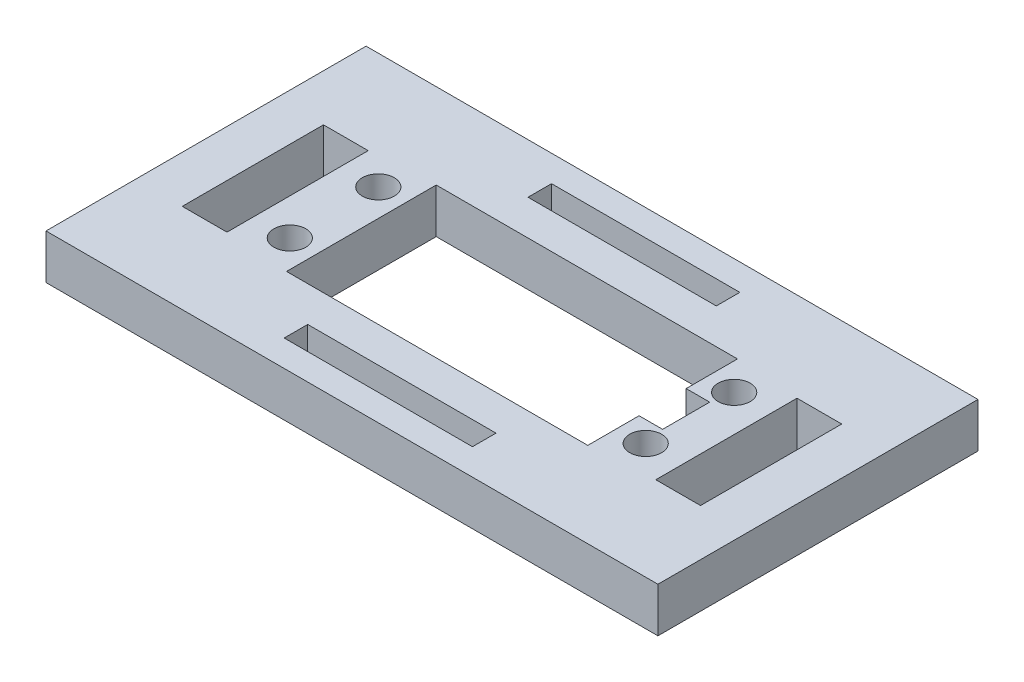
ISO-10303-21;
HEADER;
FILE_DESCRIPTION(('STEP AP214'),'2;1');
FILE_NAME('part.step','',(''),(''),'','','');
FILE_SCHEMA(('AUTOMOTIVE_DESIGN { 1 0 10303 214 1 1 1 1 }'));
ENDSEC;
DATA;
#1=APPLICATION_CONTEXT('core data for automotive mechanical design processes');
#2=APPLICATION_PROTOCOL_DEFINITION('international standard','automotive_design',2000,#1);
#3=PRODUCT_CONTEXT('',#1,'mechanical');
#4=PRODUCT('Part','Part','',(#3));
#5=PRODUCT_RELATED_PRODUCT_CATEGORY('part','',(#4));
#6=PRODUCT_DEFINITION_FORMATION('','',#4);
#7=PRODUCT_DEFINITION_CONTEXT('part definition',#1,'design');
#8=PRODUCT_DEFINITION('design','',#6,#7);
#9=PRODUCT_DEFINITION_SHAPE('','',#8);
#10=(LENGTH_UNIT() NAMED_UNIT(*) SI_UNIT(.MILLI.,.METRE.));
#11=(NAMED_UNIT(*) PLANE_ANGLE_UNIT() SI_UNIT($,.RADIAN.));
#12=(NAMED_UNIT(*) SI_UNIT($,.STERADIAN.) SOLID_ANGLE_UNIT());
#13=UNCERTAINTY_MEASURE_WITH_UNIT(LENGTH_MEASURE(1.E-05),#10,'distance_accuracy_value','');
#14=(GEOMETRIC_REPRESENTATION_CONTEXT(3) GLOBAL_UNCERTAINTY_ASSIGNED_CONTEXT((#13)) GLOBAL_UNIT_ASSIGNED_CONTEXT((#10,
#11,#12)) REPRESENTATION_CONTEXT('',''));
#15=CARTESIAN_POINT('',(0.,0.,0.));
#16=DIRECTION('',(0.,0.,1.));
#17=DIRECTION('',(1.,0.,0.));
#18=AXIS2_PLACEMENT_3D('',#15,#16,#17);
#19=CARTESIAN_POINT('',(40.64,6.0325,0.));
#20=DIRECTION('',(-1.,0.,0.));
#21=DIRECTION('',(0.,0.,1.));
#22=AXIS2_PLACEMENT_3D('',#19,#20,#21);
#23=PLANE('',#22);
#24=DIRECTION('',(0.,1.,0.));
#25=VECTOR('',#24,1.);
#26=CARTESIAN_POINT('',(40.64,-7.09951582856183,-6.9215));
#27=LINE('',#26,#25);
#28=CARTESIAN_POINT('',(40.64,0.,-6.9215));
#29=VERTEX_POINT('',#28);
#30=CARTESIAN_POINT('',(40.64,6.0325,-6.9215));
#31=VERTEX_POINT('',#30);
#32=EDGE_CURVE('E267',#29,#31,#27,.T.);
#33=ORIENTED_EDGE('',*,*,#32,.F.);
#34=DIRECTION('',(0.,0.,-1.));
#35=VECTOR('',#34,1.);
#36=CARTESIAN_POINT('',(40.64,0.,0.));
#37=LINE('',#36,#35);
#38=CARTESIAN_POINT('',(40.64,0.,0.));
#39=VERTEX_POINT('',#38);
#40=EDGE_CURVE('E252',#39,#29,#37,.T.);
#41=ORIENTED_EDGE('',*,*,#40,.F.);
#42=DIRECTION('',(0.,-1.,0.));
#43=VECTOR('',#42,1.);
#44=CARTESIAN_POINT('',(40.64,6.0325,0.));
#45=LINE('',#44,#43);
#46=CARTESIAN_POINT('',(40.64,6.0325,0.));
#47=VERTEX_POINT('',#46);
#48=EDGE_CURVE('E510',#47,#39,#45,.T.);
#49=ORIENTED_EDGE('',*,*,#48,.F.);
#50=DIRECTION('',(0.,0.,-1.));
#51=VECTOR('',#50,1.);
#52=CARTESIAN_POINT('',(40.64,6.0325,0.));
#53=LINE('',#52,#51);
#54=EDGE_CURVE('E483',#47,#31,#53,.T.);
#55=ORIENTED_EDGE('',*,*,#54,.T.);
#56=EDGE_LOOP('',(#33,#41,#49,#55));
#57=FACE_BOUND('',#56,.T.);
#58=ADVANCED_FACE('F40',(#57),#23,.T.);
#59=CARTESIAN_POINT('',(0.,6.0325,0.));
#60=DIRECTION('',(0.,-1.,0.));
#61=DIRECTION('',(0.,0.,-1.));
#62=AXIS2_PLACEMENT_3D('',#59,#60,#61);
#63=PLANE('',#62);
#64=DIRECTION('',(0.,0.,1.));
#65=VECTOR('',#64,1.);
#66=CARTESIAN_POINT('',(7.62,6.0325,4.7625));
#67=LINE('',#66,#65);
#68=CARTESIAN_POINT('',(7.62,6.0325,4.7625));
#69=VERTEX_POINT('',#68);
#70=CARTESIAN_POINT('',(7.62,6.0325,7.9375));
#71=VERTEX_POINT('',#70);
#72=EDGE_CURVE('E314',#69,#71,#67,.T.);
#73=ORIENTED_EDGE('',*,*,#72,.F.);
#74=DIRECTION('',(-1.,0.,0.));
#75=VECTOR('',#74,1.);
#76=CARTESIAN_POINT('',(7.62,6.0325,4.7625));
#77=LINE('',#76,#75);
#78=CARTESIAN_POINT('',(33.02,6.0325,4.7625));
#79=VERTEX_POINT('',#78);
#80=EDGE_CURVE('E325',#79,#69,#77,.T.);
#81=ORIENTED_EDGE('',*,*,#80,.F.);
#82=DIRECTION('',(0.,0.,-1.));
#83=VECTOR('',#82,1.);
#84=CARTESIAN_POINT('',(33.02,6.0325,4.7625));
#85=LINE('',#84,#83);
#86=CARTESIAN_POINT('',(33.02,6.0325,7.9375));
#87=VERTEX_POINT('',#86);
#88=EDGE_CURVE('E321',#87,#79,#85,.T.);
#89=ORIENTED_EDGE('',*,*,#88,.F.);
#90=DIRECTION('',(1.,0.,0.));
#91=VECTOR('',#90,1.);
#92=CARTESIAN_POINT('',(7.62,6.0325,7.9375));
#93=LINE('',#92,#91);
#94=EDGE_CURVE('E317',#71,#87,#93,.T.);
#95=ORIENTED_EDGE('',*,*,#94,.F.);
#96=EDGE_LOOP('',(#73,#81,#89,#95));
#97=FACE_BOUND('',#96,.T.);
#98=DIRECTION('',(0.,0.,1.));
#99=VECTOR('',#98,1.);
#100=CARTESIAN_POINT('',(7.62,6.0325,-24.9555));
#101=LINE('',#100,#99);
#102=CARTESIAN_POINT('',(7.62,6.0325,-28.1305));
#103=VERTEX_POINT('',#102);
#104=CARTESIAN_POINT('',(7.62,6.0325,-24.9555));
#105=VERTEX_POINT('',#104);
#106=EDGE_CURVE('E400',#103,#105,#101,.T.);
#107=ORIENTED_EDGE('',*,*,#106,.F.);
#108=DIRECTION('',(-1.,0.,0.));
#109=VECTOR('',#108,1.);
#110=CARTESIAN_POINT('',(7.62,6.0325,-28.1305));
#111=LINE('',#110,#109);
#112=CARTESIAN_POINT('',(33.02,6.0325,-28.1305));
#113=VERTEX_POINT('',#112);
#114=EDGE_CURVE('E411',#113,#103,#111,.T.);
#115=ORIENTED_EDGE('',*,*,#114,.F.);
#116=DIRECTION('',(0.,0.,-1.));
#117=VECTOR('',#116,1.);
#118=CARTESIAN_POINT('',(33.02,6.0325,-24.9555));
#119=LINE('',#118,#117);
#120=CARTESIAN_POINT('',(33.02,6.0325,-24.9555));
#121=VERTEX_POINT('',#120);
#122=EDGE_CURVE('E407',#121,#113,#119,.T.);
#123=ORIENTED_EDGE('',*,*,#122,.F.);
#124=DIRECTION('',(1.,0.,0.));
#125=VECTOR('',#124,1.);
#126=CARTESIAN_POINT('',(7.62,6.0325,-24.9555));
#127=LINE('',#126,#125);
#128=EDGE_CURVE('E403',#105,#121,#127,.T.);
#129=ORIENTED_EDGE('',*,*,#128,.F.);
#130=EDGE_LOOP('',(#107,#115,#123,#129));
#131=FACE_BOUND('',#130,.T.);
#132=DIRECTION('',(0.,0.,1.));
#133=VECTOR('',#132,1.);
#134=CARTESIAN_POINT('',(-20.955,6.0325,11.4935));
#135=LINE('',#134,#133);
#136=CARTESIAN_POINT('',(-20.955,6.0325,-31.6865));
#137=VERTEX_POINT('',#136);
#138=CARTESIAN_POINT('',(-20.955,6.0325,11.4935));
#139=VERTEX_POINT('',#138);
#140=EDGE_CURVE('E518',#137,#139,#135,.T.);
#141=ORIENTED_EDGE('',*,*,#140,.T.);
#142=DIRECTION('',(1.,0.,0.));
#143=VECTOR('',#142,1.);
#144=CARTESIAN_POINT('',(-20.955,6.0325,11.4935));
#145=LINE('',#144,#143);
#146=CARTESIAN_POINT('',(61.595,6.0325,11.4935));
#147=VERTEX_POINT('',#146);
#148=EDGE_CURVE('E522',#139,#147,#145,.T.);
#149=ORIENTED_EDGE('',*,*,#148,.T.);
#150=DIRECTION('',(0.,0.,-1.));
#151=VECTOR('',#150,1.);
#152=CARTESIAN_POINT('',(61.595,6.0325,11.4935));
#153=LINE('',#152,#151);
#154=CARTESIAN_POINT('',(61.595,6.0325,-31.6865));
#155=VERTEX_POINT('',#154);
#156=EDGE_CURVE('E526',#147,#155,#153,.T.);
#157=ORIENTED_EDGE('',*,*,#156,.T.);
#158=DIRECTION('',(-1.,0.,0.));
#159=VECTOR('',#158,1.);
#160=CARTESIAN_POINT('',(-20.955,6.0325,-31.6865));
#161=LINE('',#160,#159);
#162=EDGE_CURVE('E529',#155,#137,#161,.T.);
#163=ORIENTED_EDGE('',*,*,#162,.T.);
#164=EDGE_LOOP('',(#141,#149,#157,#163));
#165=FACE_BOUND('',#164,.T.);
#166=DIRECTION('',(0.,0.,-1.));
#167=VECTOR('',#166,1.);
#168=CARTESIAN_POINT('',(43.815,6.0325,-13.2715));
#169=LINE('',#168,#167);
#170=CARTESIAN_POINT('',(43.815,6.0325,-6.9215));
#171=VERTEX_POINT('',#170);
#172=CARTESIAN_POINT('',(43.815,6.0325,-13.2715));
#173=VERTEX_POINT('',#172);
#174=EDGE_CURVE('E256',#171,#173,#169,.T.);
#175=ORIENTED_EDGE('',*,*,#174,.F.);
#176=DIRECTION('',(1.,0.,0.));
#177=VECTOR('',#176,1.);
#178=CARTESIAN_POINT('',(40.64,6.0325,-6.9215));
#179=LINE('',#178,#177);
#180=EDGE_CURVE('E243',#31,#171,#179,.T.);
#181=ORIENTED_EDGE('',*,*,#180,.F.);
#182=ORIENTED_EDGE('',*,*,#54,.F.);
#183=DIRECTION('',(1.,0.,0.));
#184=VECTOR('',#183,1.);
#185=CARTESIAN_POINT('',(0.,6.0325,0.));
#186=LINE('',#185,#184);
#187=CARTESIAN_POINT('',(0.,6.0325,0.));
#188=VERTEX_POINT('',#187);
#189=EDGE_CURVE('E478',#188,#47,#186,.T.);
#190=ORIENTED_EDGE('',*,*,#189,.F.);
#191=DIRECTION('',(0.,0.,1.));
#192=VECTOR('',#191,1.);
#193=CARTESIAN_POINT('',(0.,6.0325,0.));
#194=LINE('',#193,#192);
#195=CARTESIAN_POINT('',(0.,6.0325,-20.193));
#196=VERTEX_POINT('',#195);
#197=EDGE_CURVE('E475',#196,#188,#194,.T.);
#198=ORIENTED_EDGE('',*,*,#197,.F.);
#199=DIRECTION('',(-1.,0.,0.));
#200=VECTOR('',#199,1.);
#201=CARTESIAN_POINT('',(0.,6.0325,-20.193));
#202=LINE('',#201,#200);
#203=CARTESIAN_POINT('',(40.64,6.0325,-20.193));
#204=VERTEX_POINT('',#203);
#205=EDGE_CURVE('E487',#204,#196,#202,.T.);
#206=ORIENTED_EDGE('',*,*,#205,.F.);
#207=CARTESIAN_POINT('',(40.64,6.0325,-13.2715));
#208=VERTEX_POINT('',#207);
#209=EDGE_CURVE('E482',#208,#204,#53,.T.);
#210=ORIENTED_EDGE('',*,*,#209,.F.);
#211=DIRECTION('',(-1.,0.,0.));
#212=VECTOR('',#211,1.);
#213=CARTESIAN_POINT('',(40.64,6.0325,-13.2715));
#214=LINE('',#213,#212);
#215=EDGE_CURVE('E56',#173,#208,#214,.T.);
#216=ORIENTED_EDGE('',*,*,#215,.F.);
#217=EDGE_LOOP('',(#175,#181,#182,#190,#198,#206,#210,#216));
#218=FACE_BOUND('',#217,.T.);
#219=CARTESIAN_POINT('',(44.323,6.0325,-16.0655));
#220=DIRECTION('',(0.,1.,0.));
#221=DIRECTION('',(0.,0.,1.));
#222=AXIS2_PLACEMENT_3D('',#219,#220,#221);
#223=CIRCLE('',#222,2.159);
#224=CARTESIAN_POINT('',(44.323,6.0325,-13.9065));
#225=VERTEX_POINT('',#224);
#226=EDGE_CURVE('E467',#225,#225,#223,.T.);
#227=ORIENTED_EDGE('',*,*,#226,.F.);
#228=EDGE_LOOP('',(#227));
#229=FACE_BOUND('',#228,.T.);
#230=CARTESIAN_POINT('',(44.323,6.0325,-4.1275));
#231=DIRECTION('',(0.,1.,0.));
#232=DIRECTION('',(0.,0.,1.));
#233=AXIS2_PLACEMENT_3D('',#230,#231,#232);
#234=CIRCLE('',#233,2.159);
#235=CARTESIAN_POINT('',(44.323,6.0325,-1.9685));
#236=VERTEX_POINT('',#235);
#237=EDGE_CURVE('E459',#236,#236,#234,.T.);
#238=ORIENTED_EDGE('',*,*,#237,.F.);
#239=EDGE_LOOP('',(#238));
#240=FACE_BOUND('',#239,.T.);
#241=CARTESIAN_POINT('',(-3.683,6.0325,-4.1275));
#242=DIRECTION('',(0.,1.,0.));
#243=DIRECTION('',(0.,0.,-1.));
#244=AXIS2_PLACEMENT_3D('',#241,#242,#243);
#245=CIRCLE('',#244,2.159);
#246=CARTESIAN_POINT('',(-3.683,6.0325,-6.2865));
#247=VERTEX_POINT('',#246);
#248=EDGE_CURVE('E451',#247,#247,#245,.T.);
#249=ORIENTED_EDGE('',*,*,#248,.F.);
#250=EDGE_LOOP('',(#249));
#251=FACE_BOUND('',#250,.T.);
#252=CARTESIAN_POINT('',(-3.683,6.0325,-16.0655));
#253=DIRECTION('',(0.,1.,0.));
#254=DIRECTION('',(0.,0.,-1.));
#255=AXIS2_PLACEMENT_3D('',#252,#253,#254);
#256=CIRCLE('',#255,2.159);
#257=CARTESIAN_POINT('',(-3.683,6.0325,-18.2245));
#258=VERTEX_POINT('',#257);
#259=EDGE_CURVE('E443',#258,#258,#256,.T.);
#260=ORIENTED_EDGE('',*,*,#259,.F.);
#261=EDGE_LOOP('',(#260));
#262=FACE_BOUND('',#261,.T.);
#263=DIRECTION('',(0.,0.,1.));
#264=VECTOR('',#263,1.);
#265=CARTESIAN_POINT('',(-14.63675,6.0325,-19.6215));
#266=LINE('',#265,#264);
#267=CARTESIAN_POINT('',(-14.63675,6.0325,-19.6215));
#268=VERTEX_POINT('',#267);
#269=CARTESIAN_POINT('',(-14.63675,6.0325,-0.571499999999998));
#270=VERTEX_POINT('',#269);
#271=EDGE_CURVE('E357',#268,#270,#266,.T.);
#272=ORIENTED_EDGE('',*,*,#271,.F.);
#273=DIRECTION('',(-1.,0.,0.));
#274=VECTOR('',#273,1.);
#275=CARTESIAN_POINT('',(-14.63675,6.0325,-19.6215));
#276=LINE('',#275,#274);
#277=CARTESIAN_POINT('',(-8.60425,6.0325,-19.6215));
#278=VERTEX_POINT('',#277);
#279=EDGE_CURVE('E368',#278,#268,#276,.T.);
#280=ORIENTED_EDGE('',*,*,#279,.F.);
#281=DIRECTION('',(0.,0.,-1.));
#282=VECTOR('',#281,1.);
#283=CARTESIAN_POINT('',(-8.60425,6.0325,-19.6215));
#284=LINE('',#283,#282);
#285=CARTESIAN_POINT('',(-8.60425,6.0325,-0.5715));
#286=VERTEX_POINT('',#285);
#287=EDGE_CURVE('E364',#286,#278,#284,.T.);
#288=ORIENTED_EDGE('',*,*,#287,.F.);
#289=DIRECTION('',(1.,0.,0.));
#290=VECTOR('',#289,1.);
#291=CARTESIAN_POINT('',(-14.63675,6.0325,-0.571499999999998));
#292=LINE('',#291,#290);
#293=EDGE_CURVE('E360',#270,#286,#292,.T.);
#294=ORIENTED_EDGE('',*,*,#293,.F.);
#295=EDGE_LOOP('',(#272,#280,#288,#294));
#296=FACE_BOUND('',#295,.T.);
#297=DIRECTION('',(0.,0.,-1.));
#298=VECTOR('',#297,1.);
#299=CARTESIAN_POINT('',(55.27675,6.0325,-19.6215));
#300=LINE('',#299,#298);
#301=CARTESIAN_POINT('',(55.27675,6.0325,-0.571499999999999));
#302=VERTEX_POINT('',#301);
#303=CARTESIAN_POINT('',(55.27675,6.0325,-19.6215));
#304=VERTEX_POINT('',#303);
#305=EDGE_CURVE('E273',#302,#304,#300,.T.);
#306=ORIENTED_EDGE('',*,*,#305,.F.);
#307=DIRECTION('',(1.,0.,0.));
#308=VECTOR('',#307,1.);
#309=CARTESIAN_POINT('',(55.27675,6.0325,-0.571499999999999));
#310=LINE('',#309,#308);
#311=CARTESIAN_POINT('',(49.24425,6.0325,-0.571499999999999));
#312=VERTEX_POINT('',#311);
#313=EDGE_CURVE('E283',#312,#302,#310,.T.);
#314=ORIENTED_EDGE('',*,*,#313,.F.);
#315=DIRECTION('',(0.,0.,1.));
#316=VECTOR('',#315,1.);
#317=CARTESIAN_POINT('',(49.24425,6.0325,-19.6215));
#318=LINE('',#317,#316);
#319=CARTESIAN_POINT('',(49.24425,6.0325,-19.6215));
#320=VERTEX_POINT('',#319);
#321=EDGE_CURVE('E280',#320,#312,#318,.T.);
#322=ORIENTED_EDGE('',*,*,#321,.F.);
#323=DIRECTION('',(-1.,0.,0.));
#324=VECTOR('',#323,1.);
#325=CARTESIAN_POINT('',(55.27675,6.0325,-19.6215));
#326=LINE('',#325,#324);
#327=EDGE_CURVE('E276',#304,#320,#326,.T.);
#328=ORIENTED_EDGE('',*,*,#327,.F.);
#329=EDGE_LOOP('',(#306,#314,#322,#328));
#330=FACE_BOUND('',#329,.T.);
#331=ADVANCED_FACE('F571',(#97,#131,#165,#218,#229,#240,#251,#262,#296,#330),#63,.F.);
#332=CARTESIAN_POINT('',(0.,0.,0.));
#333=DIRECTION('',(0.,-1.,0.));
#334=DIRECTION('',(0.,0.,-1.));
#335=AXIS2_PLACEMENT_3D('',#332,#333,#334);
#336=PLANE('',#335);
#337=DIRECTION('',(1.,0.,0.));
#338=VECTOR('',#337,1.);
#339=CARTESIAN_POINT('',(40.64,0.,-6.9215));
#340=LINE('',#339,#338);
#341=CARTESIAN_POINT('',(43.815,0.,-6.9215));
#342=VERTEX_POINT('',#341);
#343=EDGE_CURVE('E240',#29,#342,#340,.T.);
#344=ORIENTED_EDGE('',*,*,#343,.T.);
#345=DIRECTION('',(0.,0.,-1.));
#346=VECTOR('',#345,1.);
#347=CARTESIAN_POINT('',(43.815,0.,-13.2715));
#348=LINE('',#347,#346);
#349=CARTESIAN_POINT('',(43.815,0.,-13.2715));
#350=VERTEX_POINT('',#349);
#351=EDGE_CURVE('E226',#342,#350,#348,.T.);
#352=ORIENTED_EDGE('',*,*,#351,.T.);
#353=DIRECTION('',(-1.,0.,0.));
#354=VECTOR('',#353,1.);
#355=CARTESIAN_POINT('',(40.64,0.,-13.2715));
#356=LINE('',#355,#354);
#357=CARTESIAN_POINT('',(40.64,0.,-13.2715));
#358=VERTEX_POINT('',#357);
#359=EDGE_CURVE('E261',#350,#358,#356,.T.);
#360=ORIENTED_EDGE('',*,*,#359,.T.);
#361=CARTESIAN_POINT('',(40.64,0.,-20.193));
#362=VERTEX_POINT('',#361);
#363=EDGE_CURVE('E497',#358,#362,#37,.T.);
#364=ORIENTED_EDGE('',*,*,#363,.T.);
#365=DIRECTION('',(-1.,0.,0.));
#366=VECTOR('',#365,1.);
#367=CARTESIAN_POINT('',(0.,0.,-20.193));
#368=LINE('',#367,#366);
#369=CARTESIAN_POINT('',(0.,0.,-20.193));
#370=VERTEX_POINT('',#369);
#371=EDGE_CURVE('E479',#362,#370,#368,.T.);
#372=ORIENTED_EDGE('',*,*,#371,.T.);
#373=DIRECTION('',(0.,0.,1.));
#374=VECTOR('',#373,1.);
#375=CARTESIAN_POINT('',(0.,0.,0.));
#376=LINE('',#375,#374);
#377=CARTESIAN_POINT('',(0.,0.,0.));
#378=VERTEX_POINT('',#377);
#379=EDGE_CURVE('E471',#370,#378,#376,.T.);
#380=ORIENTED_EDGE('',*,*,#379,.T.);
#381=DIRECTION('',(1.,0.,0.));
#382=VECTOR('',#381,1.);
#383=CARTESIAN_POINT('',(0.,0.,0.));
#384=LINE('',#383,#382);
#385=EDGE_CURVE('E494',#378,#39,#384,.T.);
#386=ORIENTED_EDGE('',*,*,#385,.T.);
#387=ORIENTED_EDGE('',*,*,#40,.T.);
#388=EDGE_LOOP('',(#344,#352,#360,#364,#372,#380,#386,#387));
#389=FACE_BOUND('',#388,.T.);
#390=CARTESIAN_POINT('',(-3.683,0.,-4.1275));
#391=DIRECTION('',(0.,1.,0.));
#392=DIRECTION('',(0.,0.,-1.));
#393=AXIS2_PLACEMENT_3D('',#390,#391,#392);
#394=CIRCLE('',#393,2.159);
#395=CARTESIAN_POINT('',(-3.683,0.,-6.2865));
#396=VERTEX_POINT('',#395);
#397=EDGE_CURVE('E447',#396,#396,#394,.T.);
#398=ORIENTED_EDGE('',*,*,#397,.T.);
#399=EDGE_LOOP('',(#398));
#400=FACE_BOUND('',#399,.T.);
#401=CARTESIAN_POINT('',(44.323,0.,-16.0655));
#402=DIRECTION('',(0.,1.,0.));
#403=DIRECTION('',(0.,0.,1.));
#404=AXIS2_PLACEMENT_3D('',#401,#402,#403);
#405=CIRCLE('',#404,2.159);
#406=CARTESIAN_POINT('',(44.323,0.,-13.9065));
#407=VERTEX_POINT('',#406);
#408=EDGE_CURVE('E463',#407,#407,#405,.T.);
#409=ORIENTED_EDGE('',*,*,#408,.T.);
#410=EDGE_LOOP('',(#409));
#411=FACE_BOUND('',#410,.T.);
#412=DIRECTION('',(0.,0.,1.));
#413=VECTOR('',#412,1.);
#414=CARTESIAN_POINT('',(-20.955,0.,11.4935));
#415=LINE('',#414,#413);
#416=CARTESIAN_POINT('',(-20.955,0.,-31.6865));
#417=VERTEX_POINT('',#416);
#418=CARTESIAN_POINT('',(-20.955,0.,11.4935));
#419=VERTEX_POINT('',#418);
#420=EDGE_CURVE('E517',#417,#419,#415,.T.);
#421=ORIENTED_EDGE('',*,*,#420,.F.);
#422=DIRECTION('',(-1.,0.,0.));
#423=VECTOR('',#422,1.);
#424=CARTESIAN_POINT('',(-20.955,0.,-31.6865));
#425=LINE('',#424,#423);
#426=CARTESIAN_POINT('',(61.595,0.,-31.6865));
#427=VERTEX_POINT('',#426);
#428=EDGE_CURVE('E523',#427,#417,#425,.T.);
#429=ORIENTED_EDGE('',*,*,#428,.F.);
#430=DIRECTION('',(0.,0.,-1.));
#431=VECTOR('',#430,1.);
#432=CARTESIAN_POINT('',(61.595,0.,11.4935));
#433=LINE('',#432,#431);
#434=CARTESIAN_POINT('',(61.595,0.,11.4935));
#435=VERTEX_POINT('',#434);
#436=EDGE_CURVE('E539',#435,#427,#433,.T.);
#437=ORIENTED_EDGE('',*,*,#436,.F.);
#438=DIRECTION('',(1.,0.,0.));
#439=VECTOR('',#438,1.);
#440=CARTESIAN_POINT('',(-20.955,0.,11.4935));
#441=LINE('',#440,#439);
#442=EDGE_CURVE('E536',#419,#435,#441,.T.);
#443=ORIENTED_EDGE('',*,*,#442,.F.);
#444=EDGE_LOOP('',(#421,#429,#437,#443));
#445=FACE_BOUND('',#444,.T.);
#446=CARTESIAN_POINT('',(44.323,0.,-4.1275));
#447=DIRECTION('',(0.,1.,0.));
#448=DIRECTION('',(0.,0.,1.));
#449=AXIS2_PLACEMENT_3D('',#446,#447,#448);
#450=CIRCLE('',#449,2.159);
#451=CARTESIAN_POINT('',(44.323,0.,-1.9685));
#452=VERTEX_POINT('',#451);
#453=EDGE_CURVE('E455',#452,#452,#450,.T.);
#454=ORIENTED_EDGE('',*,*,#453,.T.);
#455=EDGE_LOOP('',(#454));
#456=FACE_BOUND('',#455,.T.);
#457=CARTESIAN_POINT('',(-3.683,0.,-16.0655));
#458=DIRECTION('',(0.,1.,0.));
#459=DIRECTION('',(0.,0.,-1.));
#460=AXIS2_PLACEMENT_3D('',#457,#458,#459);
#461=CIRCLE('',#460,2.159);
#462=CARTESIAN_POINT('',(-3.683,0.,-18.2245));
#463=VERTEX_POINT('',#462);
#464=EDGE_CURVE('E442',#463,#463,#461,.T.);
#465=ORIENTED_EDGE('',*,*,#464,.T.);
#466=EDGE_LOOP('',(#465));
#467=FACE_BOUND('',#466,.T.);
#468=DIRECTION('',(-1.,0.,0.));
#469=VECTOR('',#468,1.);
#470=CARTESIAN_POINT('',(7.62,0.,-28.1305));
#471=LINE('',#470,#469);
#472=CARTESIAN_POINT('',(33.02,0.,-28.1305));
#473=VERTEX_POINT('',#472);
#474=CARTESIAN_POINT('',(7.62,0.,-28.1305));
#475=VERTEX_POINT('',#474);
#476=EDGE_CURVE('E404',#473,#475,#471,.T.);
#477=ORIENTED_EDGE('',*,*,#476,.T.);
#478=DIRECTION('',(0.,0.,1.));
#479=VECTOR('',#478,1.);
#480=CARTESIAN_POINT('',(7.62,0.,-24.9555));
#481=LINE('',#480,#479);
#482=CARTESIAN_POINT('',(7.62,0.,-24.9555));
#483=VERTEX_POINT('',#482);
#484=EDGE_CURVE('E399',#475,#483,#481,.T.);
#485=ORIENTED_EDGE('',*,*,#484,.T.);
#486=DIRECTION('',(1.,0.,0.));
#487=VECTOR('',#486,1.);
#488=CARTESIAN_POINT('',(7.62,0.,-24.9555));
#489=LINE('',#488,#487);
#490=CARTESIAN_POINT('',(33.02,0.,-24.9555));
#491=VERTEX_POINT('',#490);
#492=EDGE_CURVE('E418',#483,#491,#489,.T.);
#493=ORIENTED_EDGE('',*,*,#492,.T.);
#494=DIRECTION('',(0.,0.,-1.));
#495=VECTOR('',#494,1.);
#496=CARTESIAN_POINT('',(33.02,0.,-24.9555));
#497=LINE('',#496,#495);
#498=EDGE_CURVE('E422',#491,#473,#497,.T.);
#499=ORIENTED_EDGE('',*,*,#498,.T.);
#500=EDGE_LOOP('',(#477,#485,#493,#499));
#501=FACE_BOUND('',#500,.T.);
#502=DIRECTION('',(-1.,0.,0.));
#503=VECTOR('',#502,1.);
#504=CARTESIAN_POINT('',(-14.63675,0.,-19.6215));
#505=LINE('',#504,#503);
#506=CARTESIAN_POINT('',(-8.60425,0.,-19.6215));
#507=VERTEX_POINT('',#506);
#508=CARTESIAN_POINT('',(-14.63675,0.,-19.6215));
#509=VERTEX_POINT('',#508);
#510=EDGE_CURVE('E361',#507,#509,#505,.T.);
#511=ORIENTED_EDGE('',*,*,#510,.T.);
#512=DIRECTION('',(0.,0.,1.));
#513=VECTOR('',#512,1.);
#514=CARTESIAN_POINT('',(-14.63675,0.,-19.6215));
#515=LINE('',#514,#513);
#516=CARTESIAN_POINT('',(-14.63675,0.,-0.571499999999998));
#517=VERTEX_POINT('',#516);
#518=EDGE_CURVE('E356',#509,#517,#515,.T.);
#519=ORIENTED_EDGE('',*,*,#518,.T.);
#520=DIRECTION('',(1.,0.,0.));
#521=VECTOR('',#520,1.);
#522=CARTESIAN_POINT('',(-14.63675,0.,-0.571499999999998));
#523=LINE('',#522,#521);
#524=CARTESIAN_POINT('',(-8.60425,0.,-0.5715));
#525=VERTEX_POINT('',#524);
#526=EDGE_CURVE('E375',#517,#525,#523,.T.);
#527=ORIENTED_EDGE('',*,*,#526,.T.);
#528=DIRECTION('',(0.,0.,-1.));
#529=VECTOR('',#528,1.);
#530=CARTESIAN_POINT('',(-8.60425,0.,-19.6215));
#531=LINE('',#530,#529);
#532=EDGE_CURVE('E379',#525,#507,#531,.T.);
#533=ORIENTED_EDGE('',*,*,#532,.T.);
#534=EDGE_LOOP('',(#511,#519,#527,#533));
#535=FACE_BOUND('',#534,.T.);
#536=DIRECTION('',(-1.,0.,0.));
#537=VECTOR('',#536,1.);
#538=CARTESIAN_POINT('',(7.62,0.,4.7625));
#539=LINE('',#538,#537);
#540=CARTESIAN_POINT('',(33.02,0.,4.7625));
#541=VERTEX_POINT('',#540);
#542=CARTESIAN_POINT('',(7.62,0.,4.7625));
#543=VERTEX_POINT('',#542);
#544=EDGE_CURVE('E318',#541,#543,#539,.T.);
#545=ORIENTED_EDGE('',*,*,#544,.T.);
#546=DIRECTION('',(0.,0.,1.));
#547=VECTOR('',#546,1.);
#548=CARTESIAN_POINT('',(7.62,0.,4.7625));
#549=LINE('',#548,#547);
#550=CARTESIAN_POINT('',(7.62,0.,7.9375));
#551=VERTEX_POINT('',#550);
#552=EDGE_CURVE('E313',#543,#551,#549,.T.);
#553=ORIENTED_EDGE('',*,*,#552,.T.);
#554=DIRECTION('',(1.,0.,0.));
#555=VECTOR('',#554,1.);
#556=CARTESIAN_POINT('',(7.62,0.,7.9375));
#557=LINE('',#556,#555);
#558=CARTESIAN_POINT('',(33.02,0.,7.9375));
#559=VERTEX_POINT('',#558);
#560=EDGE_CURVE('E332',#551,#559,#557,.T.);
#561=ORIENTED_EDGE('',*,*,#560,.T.);
#562=DIRECTION('',(0.,0.,-1.));
#563=VECTOR('',#562,1.);
#564=CARTESIAN_POINT('',(33.02,0.,4.7625));
#565=LINE('',#564,#563);
#566=EDGE_CURVE('E336',#559,#541,#565,.T.);
#567=ORIENTED_EDGE('',*,*,#566,.T.);
#568=EDGE_LOOP('',(#545,#553,#561,#567));
#569=FACE_BOUND('',#568,.T.);
#570=DIRECTION('',(1.,0.,0.));
#571=VECTOR('',#570,1.);
#572=CARTESIAN_POINT('',(55.27675,0.,-0.571499999999999));
#573=LINE('',#572,#571);
#574=CARTESIAN_POINT('',(49.24425,0.,-0.571499999999999));
#575=VERTEX_POINT('',#574);
#576=CARTESIAN_POINT('',(55.27675,0.,-0.571499999999999));
#577=VERTEX_POINT('',#576);
#578=EDGE_CURVE('E277',#575,#577,#573,.T.);
#579=ORIENTED_EDGE('',*,*,#578,.T.);
#580=DIRECTION('',(0.,0.,-1.));
#581=VECTOR('',#580,1.);
#582=CARTESIAN_POINT('',(55.27675,0.,-19.6215));
#583=LINE('',#582,#581);
#584=CARTESIAN_POINT('',(55.27675,0.,-19.6215));
#585=VERTEX_POINT('',#584);
#586=EDGE_CURVE('E272',#577,#585,#583,.T.);
#587=ORIENTED_EDGE('',*,*,#586,.T.);
#588=DIRECTION('',(-1.,0.,0.));
#589=VECTOR('',#588,1.);
#590=CARTESIAN_POINT('',(55.27675,0.,-19.6215));
#591=LINE('',#590,#589);
#592=CARTESIAN_POINT('',(49.24425,0.,-19.6215));
#593=VERTEX_POINT('',#592);
#594=EDGE_CURVE('E290',#585,#593,#591,.T.);
#595=ORIENTED_EDGE('',*,*,#594,.T.);
#596=DIRECTION('',(0.,0.,1.));
#597=VECTOR('',#596,1.);
#598=CARTESIAN_POINT('',(49.24425,0.,-19.6215));
#599=LINE('',#598,#597);
#600=EDGE_CURVE('E294',#593,#575,#599,.T.);
#601=ORIENTED_EDGE('',*,*,#600,.T.);
#602=EDGE_LOOP('',(#579,#587,#595,#601));
#603=FACE_BOUND('',#602,.T.);
#604=ADVANCED_FACE('F248',(#389,#400,#411,#445,#456,#467,#501,#535,#569,#603),#336,.T.);
#605=CARTESIAN_POINT('',(-20.955,6.0325,11.4935));
#606=DIRECTION('',(1.,0.,0.));
#607=DIRECTION('',(0.,0.,-1.));
#608=AXIS2_PLACEMENT_3D('',#605,#606,#607);
#609=PLANE('',#608);
#610=ORIENTED_EDGE('',*,*,#420,.T.);
#611=DIRECTION('',(0.,-1.,0.));
#612=VECTOR('',#611,1.);
#613=CARTESIAN_POINT('',(-20.955,6.0325,11.4935));
#614=LINE('',#613,#612);
#615=EDGE_CURVE('E11',#139,#419,#614,.T.);
#616=ORIENTED_EDGE('',*,*,#615,.F.);
#617=ORIENTED_EDGE('',*,*,#140,.F.);
#618=DIRECTION('',(0.,-1.,0.));
#619=VECTOR('',#618,1.);
#620=CARTESIAN_POINT('',(-20.955,6.0325,-31.6865));
#621=LINE('',#620,#619);
#622=EDGE_CURVE('E532',#137,#417,#621,.T.);
#623=ORIENTED_EDGE('',*,*,#622,.T.);
#624=EDGE_LOOP('',(#610,#616,#617,#623));
#625=FACE_BOUND('',#624,.T.);
#626=ADVANCED_FACE('F42',(#625),#609,.F.);
#627=CARTESIAN_POINT('',(-20.955,6.0325,11.4935));
#628=DIRECTION('',(0.,0.,-1.));
#629=DIRECTION('',(-1.,0.,0.));
#630=AXIS2_PLACEMENT_3D('',#627,#628,#629);
#631=PLANE('',#630);
#632=ORIENTED_EDGE('',*,*,#442,.T.);
#633=DIRECTION('',(0.,-1.,0.));
#634=VECTOR('',#633,1.);
#635=CARTESIAN_POINT('',(61.595,6.0325,11.4935));
#636=LINE('',#635,#634);
#637=EDGE_CURVE('E49',#147,#435,#636,.T.);
#638=ORIENTED_EDGE('',*,*,#637,.F.);
#639=ORIENTED_EDGE('',*,*,#148,.F.);
#640=ORIENTED_EDGE('',*,*,#615,.T.);
#641=EDGE_LOOP('',(#632,#638,#639,#640));
#642=FACE_BOUND('',#641,.T.);
#643=ADVANCED_FACE('F573',(#642),#631,.F.);
#644=CARTESIAN_POINT('',(61.595,6.0325,11.4935));
#645=DIRECTION('',(-1.,0.,0.));
#646=DIRECTION('',(0.,0.,1.));
#647=AXIS2_PLACEMENT_3D('',#644,#645,#646);
#648=PLANE('',#647);
#649=ORIENTED_EDGE('',*,*,#436,.T.);
#650=DIRECTION('',(0.,-1.,0.));
#651=VECTOR('',#650,1.);
#652=CARTESIAN_POINT('',(61.595,6.0325,-31.6865));
#653=LINE('',#652,#651);
#654=EDGE_CURVE('E547',#155,#427,#653,.T.);
#655=ORIENTED_EDGE('',*,*,#654,.F.);
#656=ORIENTED_EDGE('',*,*,#156,.F.);
#657=ORIENTED_EDGE('',*,*,#637,.T.);
#658=EDGE_LOOP('',(#649,#655,#656,#657));
#659=FACE_BOUND('',#658,.T.);
#660=ADVANCED_FACE('F556',(#659),#648,.F.);
#661=CARTESIAN_POINT('',(-20.955,6.0325,-31.6865));
#662=DIRECTION('',(0.,0.,1.));
#663=DIRECTION('',(1.,0.,0.));
#664=AXIS2_PLACEMENT_3D('',#661,#662,#663);
#665=PLANE('',#664);
#666=ORIENTED_EDGE('',*,*,#428,.T.);
#667=ORIENTED_EDGE('',*,*,#622,.F.);
#668=ORIENTED_EDGE('',*,*,#162,.F.);
#669=ORIENTED_EDGE('',*,*,#654,.T.);
#670=EDGE_LOOP('',(#666,#667,#668,#669));
#671=FACE_BOUND('',#670,.T.);
#672=ADVANCED_FACE('F565',(#671),#665,.F.);
#673=CARTESIAN_POINT('',(0.,6.0325,0.));
#674=DIRECTION('',(1.,0.,0.));
#675=DIRECTION('',(0.,0.,-1.));
#676=AXIS2_PLACEMENT_3D('',#673,#674,#675);
#677=PLANE('',#676);
#678=ORIENTED_EDGE('',*,*,#379,.F.);
#679=DIRECTION('',(0.,-1.,0.));
#680=VECTOR('',#679,1.);
#681=CARTESIAN_POINT('',(0.,6.0325,-20.193));
#682=LINE('',#681,#680);
#683=EDGE_CURVE('E490',#196,#370,#682,.T.);
#684=ORIENTED_EDGE('',*,*,#683,.F.);
#685=ORIENTED_EDGE('',*,*,#197,.T.);
#686=DIRECTION('',(0.,-1.,0.));
#687=VECTOR('',#686,1.);
#688=CARTESIAN_POINT('',(0.,6.0325,0.));
#689=LINE('',#688,#687);
#690=EDGE_CURVE('E513',#188,#378,#689,.T.);
#691=ORIENTED_EDGE('',*,*,#690,.T.);
#692=EDGE_LOOP('',(#678,#684,#685,#691));
#693=FACE_BOUND('',#692,.T.);
#694=ADVANCED_FACE('F601',(#693),#677,.T.);
#695=CARTESIAN_POINT('',(0.,6.0325,0.));
#696=DIRECTION('',(0.,0.,-1.));
#697=DIRECTION('',(-1.,0.,0.));
#698=AXIS2_PLACEMENT_3D('',#695,#696,#697);
#699=PLANE('',#698);
#700=ORIENTED_EDGE('',*,*,#385,.F.);
#701=ORIENTED_EDGE('',*,*,#690,.F.);
#702=ORIENTED_EDGE('',*,*,#189,.T.);
#703=ORIENTED_EDGE('',*,*,#48,.T.);
#704=EDGE_LOOP('',(#700,#701,#702,#703));
#705=FACE_BOUND('',#704,.T.);
#706=ADVANCED_FACE('F593',(#705),#699,.T.);
#707=DIRECTION('',(0.,1.,0.));
#708=VECTOR('',#707,1.);
#709=CARTESIAN_POINT('',(40.64,-7.09951582856183,-13.2715));
#710=LINE('',#709,#708);
#711=EDGE_CURVE('E263',#358,#208,#710,.T.);
#712=ORIENTED_EDGE('',*,*,#711,.T.);
#713=ORIENTED_EDGE('',*,*,#209,.T.);
#714=DIRECTION('',(0.,-1.,0.));
#715=VECTOR('',#714,1.);
#716=CARTESIAN_POINT('',(40.64,6.0325,-20.193));
#717=LINE('',#716,#715);
#718=EDGE_CURVE('E506',#204,#362,#717,.T.);
#719=ORIENTED_EDGE('',*,*,#718,.T.);
#720=ORIENTED_EDGE('',*,*,#363,.F.);
#721=EDGE_LOOP('',(#712,#713,#719,#720));
#722=FACE_BOUND('',#721,.T.);
#723=ADVANCED_FACE('F583',(#722),#23,.T.);
#724=CARTESIAN_POINT('',(0.,6.0325,-20.193));
#725=DIRECTION('',(0.,0.,1.));
#726=DIRECTION('',(1.,0.,0.));
#727=AXIS2_PLACEMENT_3D('',#724,#725,#726);
#728=PLANE('',#727);
#729=ORIENTED_EDGE('',*,*,#371,.F.);
#730=ORIENTED_EDGE('',*,*,#718,.F.);
#731=ORIENTED_EDGE('',*,*,#205,.T.);
#732=ORIENTED_EDGE('',*,*,#683,.T.);
#733=EDGE_LOOP('',(#729,#730,#731,#732));
#734=FACE_BOUND('',#733,.T.);
#735=ADVANCED_FACE('F592',(#734),#728,.T.);
#736=CARTESIAN_POINT('',(44.323,6.0325,-16.0655));
#737=DIRECTION('',(0.,-1.,0.));
#738=DIRECTION('',(0.,0.,-1.));
#739=AXIS2_PLACEMENT_3D('',#736,#737,#738);
#740=CYLINDRICAL_SURFACE('',#739,2.159);
#741=ORIENTED_EDGE('',*,*,#226,.T.);
#742=EDGE_LOOP('',(#741));
#743=FACE_BOUND('',#742,.T.);
#744=ORIENTED_EDGE('',*,*,#408,.F.);
#745=EDGE_LOOP('',(#744));
#746=FACE_BOUND('',#745,.T.);
#747=ADVANCED_FACE('F599',(#743,#746),#740,.F.);
#748=CARTESIAN_POINT('',(44.323,6.0325,-4.1275));
#749=DIRECTION('',(0.,-1.,0.));
#750=DIRECTION('',(0.,0.,-1.));
#751=AXIS2_PLACEMENT_3D('',#748,#749,#750);
#752=CYLINDRICAL_SURFACE('',#751,2.159);
#753=ORIENTED_EDGE('',*,*,#237,.T.);
#754=EDGE_LOOP('',(#753));
#755=FACE_BOUND('',#754,.T.);
#756=ORIENTED_EDGE('',*,*,#453,.F.);
#757=EDGE_LOOP('',(#756));
#758=FACE_BOUND('',#757,.T.);
#759=ADVANCED_FACE('F678',(#755,#758),#752,.F.);
#760=CARTESIAN_POINT('',(-3.683,6.0325,-4.1275));
#761=DIRECTION('',(0.,-1.,0.));
#762=DIRECTION('',(0.,0.,-1.));
#763=AXIS2_PLACEMENT_3D('',#760,#761,#762);
#764=CYLINDRICAL_SURFACE('',#763,2.159);
#765=ORIENTED_EDGE('',*,*,#248,.T.);
#766=EDGE_LOOP('',(#765));
#767=FACE_BOUND('',#766,.T.);
#768=ORIENTED_EDGE('',*,*,#397,.F.);
#769=EDGE_LOOP('',(#768));
#770=FACE_BOUND('',#769,.T.);
#771=ADVANCED_FACE('F688',(#767,#770),#764,.F.);
#772=CARTESIAN_POINT('',(-3.683,6.0325,-16.0655));
#773=DIRECTION('',(0.,-1.,0.));
#774=DIRECTION('',(0.,0.,-1.));
#775=AXIS2_PLACEMENT_3D('',#772,#773,#774);
#776=CYLINDRICAL_SURFACE('',#775,2.159);
#777=ORIENTED_EDGE('',*,*,#259,.T.);
#778=EDGE_LOOP('',(#777));
#779=FACE_BOUND('',#778,.T.);
#780=ORIENTED_EDGE('',*,*,#464,.F.);
#781=EDGE_LOOP('',(#780));
#782=FACE_BOUND('',#781,.T.);
#783=ADVANCED_FACE('F698',(#779,#782),#776,.F.);
#784=CARTESIAN_POINT('',(7.62,6.0325,-24.9555));
#785=DIRECTION('',(1.,0.,0.));
#786=DIRECTION('',(0.,0.,-1.));
#787=AXIS2_PLACEMENT_3D('',#784,#785,#786);
#788=PLANE('',#787);
#789=ORIENTED_EDGE('',*,*,#484,.F.);
#790=DIRECTION('',(0.,-1.,0.));
#791=VECTOR('',#790,1.);
#792=CARTESIAN_POINT('',(7.62,6.0325,-28.1305));
#793=LINE('',#792,#791);
#794=EDGE_CURVE('E414',#103,#475,#793,.T.);
#795=ORIENTED_EDGE('',*,*,#794,.F.);
#796=ORIENTED_EDGE('',*,*,#106,.T.);
#797=DIRECTION('',(0.,-1.,0.));
#798=VECTOR('',#797,1.);
#799=CARTESIAN_POINT('',(7.62,6.0325,-24.9555));
#800=LINE('',#799,#798);
#801=EDGE_CURVE('E438',#105,#483,#800,.T.);
#802=ORIENTED_EDGE('',*,*,#801,.T.);
#803=EDGE_LOOP('',(#789,#795,#796,#802));
#804=FACE_BOUND('',#803,.T.);
#805=ADVANCED_FACE('F708',(#804),#788,.T.);
#806=CARTESIAN_POINT('',(7.62,6.0325,-24.9555));
#807=DIRECTION('',(0.,0.,-1.));
#808=DIRECTION('',(-1.,0.,0.));
#809=AXIS2_PLACEMENT_3D('',#806,#807,#808);
#810=PLANE('',#809);
#811=ORIENTED_EDGE('',*,*,#492,.F.);
#812=ORIENTED_EDGE('',*,*,#801,.F.);
#813=ORIENTED_EDGE('',*,*,#128,.T.);
#814=DIRECTION('',(0.,-1.,0.));
#815=VECTOR('',#814,1.);
#816=CARTESIAN_POINT('',(33.02,6.0325,-24.9555));
#817=LINE('',#816,#815);
#818=EDGE_CURVE('E435',#121,#491,#817,.T.);
#819=ORIENTED_EDGE('',*,*,#818,.T.);
#820=EDGE_LOOP('',(#811,#812,#813,#819));
#821=FACE_BOUND('',#820,.T.);
#822=ADVANCED_FACE('F718',(#821),#810,.T.);
#823=CARTESIAN_POINT('',(33.02,6.0325,-24.9555));
#824=DIRECTION('',(-1.,0.,0.));
#825=DIRECTION('',(0.,0.,1.));
#826=AXIS2_PLACEMENT_3D('',#823,#824,#825);
#827=PLANE('',#826);
#828=ORIENTED_EDGE('',*,*,#498,.F.);
#829=ORIENTED_EDGE('',*,*,#818,.F.);
#830=ORIENTED_EDGE('',*,*,#122,.T.);
#831=DIRECTION('',(0.,-1.,0.));
#832=VECTOR('',#831,1.);
#833=CARTESIAN_POINT('',(33.02,6.0325,-28.1305));
#834=LINE('',#833,#832);
#835=EDGE_CURVE('E432',#113,#473,#834,.T.);
#836=ORIENTED_EDGE('',*,*,#835,.T.);
#837=EDGE_LOOP('',(#828,#829,#830,#836));
#838=FACE_BOUND('',#837,.T.);
#839=ADVANCED_FACE('F728',(#838),#827,.T.);
#840=CARTESIAN_POINT('',(7.62,6.0325,-28.1305));
#841=DIRECTION('',(0.,0.,1.));
#842=DIRECTION('',(1.,0.,0.));
#843=AXIS2_PLACEMENT_3D('',#840,#841,#842);
#844=PLANE('',#843);
#845=ORIENTED_EDGE('',*,*,#476,.F.);
#846=ORIENTED_EDGE('',*,*,#835,.F.);
#847=ORIENTED_EDGE('',*,*,#114,.T.);
#848=ORIENTED_EDGE('',*,*,#794,.T.);
#849=EDGE_LOOP('',(#845,#846,#847,#848));
#850=FACE_BOUND('',#849,.T.);
#851=ADVANCED_FACE('F738',(#850),#844,.T.);
#852=CARTESIAN_POINT('',(-14.63675,6.0325,-19.6215));
#853=DIRECTION('',(1.,0.,0.));
#854=DIRECTION('',(0.,0.,-1.));
#855=AXIS2_PLACEMENT_3D('',#852,#853,#854);
#856=PLANE('',#855);
#857=ORIENTED_EDGE('',*,*,#518,.F.);
#858=DIRECTION('',(0.,-1.,0.));
#859=VECTOR('',#858,1.);
#860=CARTESIAN_POINT('',(-14.63675,6.0325,-19.6215));
#861=LINE('',#860,#859);
#862=EDGE_CURVE('E371',#268,#509,#861,.T.);
#863=ORIENTED_EDGE('',*,*,#862,.F.);
#864=ORIENTED_EDGE('',*,*,#271,.T.);
#865=DIRECTION('',(0.,-1.,0.));
#866=VECTOR('',#865,1.);
#867=CARTESIAN_POINT('',(-14.63675,6.0325,-0.571499999999998));
#868=LINE('',#867,#866);
#869=EDGE_CURVE('E395',#270,#517,#868,.T.);
#870=ORIENTED_EDGE('',*,*,#869,.T.);
#871=EDGE_LOOP('',(#857,#863,#864,#870));
#872=FACE_BOUND('',#871,.T.);
#873=ADVANCED_FACE('F748',(#872),#856,.T.);
#874=CARTESIAN_POINT('',(-14.63675,6.0325,-0.571499999999998));
#875=DIRECTION('',(0.,0.,-1.));
#876=DIRECTION('',(-1.,0.,0.));
#877=AXIS2_PLACEMENT_3D('',#874,#875,#876);
#878=PLANE('',#877);
#879=ORIENTED_EDGE('',*,*,#526,.F.);
#880=ORIENTED_EDGE('',*,*,#869,.F.);
#881=ORIENTED_EDGE('',*,*,#293,.T.);
#882=DIRECTION('',(0.,-1.,0.));
#883=VECTOR('',#882,1.);
#884=CARTESIAN_POINT('',(-8.60425,6.0325,-0.5715));
#885=LINE('',#884,#883);
#886=EDGE_CURVE('E392',#286,#525,#885,.T.);
#887=ORIENTED_EDGE('',*,*,#886,.T.);
#888=EDGE_LOOP('',(#879,#880,#881,#887));
#889=FACE_BOUND('',#888,.T.);
#890=ADVANCED_FACE('F758',(#889),#878,.T.);
#891=CARTESIAN_POINT('',(-8.60425,6.0325,-19.6215));
#892=DIRECTION('',(-1.,0.,0.));
#893=DIRECTION('',(0.,0.,1.));
#894=AXIS2_PLACEMENT_3D('',#891,#892,#893);
#895=PLANE('',#894);
#896=ORIENTED_EDGE('',*,*,#532,.F.);
#897=ORIENTED_EDGE('',*,*,#886,.F.);
#898=ORIENTED_EDGE('',*,*,#287,.T.);
#899=DIRECTION('',(0.,-1.,0.));
#900=VECTOR('',#899,1.);
#901=CARTESIAN_POINT('',(-8.60425,6.0325,-19.6215));
#902=LINE('',#901,#900);
#903=EDGE_CURVE('E389',#278,#507,#902,.T.);
#904=ORIENTED_EDGE('',*,*,#903,.T.);
#905=EDGE_LOOP('',(#896,#897,#898,#904));
#906=FACE_BOUND('',#905,.T.);
#907=ADVANCED_FACE('F768',(#906),#895,.T.);
#908=CARTESIAN_POINT('',(-14.63675,6.0325,-19.6215));
#909=DIRECTION('',(0.,0.,1.));
#910=DIRECTION('',(1.,0.,0.));
#911=AXIS2_PLACEMENT_3D('',#908,#909,#910);
#912=PLANE('',#911);
#913=ORIENTED_EDGE('',*,*,#510,.F.);
#914=ORIENTED_EDGE('',*,*,#903,.F.);
#915=ORIENTED_EDGE('',*,*,#279,.T.);
#916=ORIENTED_EDGE('',*,*,#862,.T.);
#917=EDGE_LOOP('',(#913,#914,#915,#916));
#918=FACE_BOUND('',#917,.T.);
#919=ADVANCED_FACE('F778',(#918),#912,.T.);
#920=CARTESIAN_POINT('',(7.62,6.0325,4.7625));
#921=DIRECTION('',(1.,0.,0.));
#922=DIRECTION('',(0.,0.,-1.));
#923=AXIS2_PLACEMENT_3D('',#920,#921,#922);
#924=PLANE('',#923);
#925=ORIENTED_EDGE('',*,*,#552,.F.);
#926=DIRECTION('',(0.,-1.,0.));
#927=VECTOR('',#926,1.);
#928=CARTESIAN_POINT('',(7.62,6.0325,4.7625));
#929=LINE('',#928,#927);
#930=EDGE_CURVE('E328',#69,#543,#929,.T.);
#931=ORIENTED_EDGE('',*,*,#930,.F.);
#932=ORIENTED_EDGE('',*,*,#72,.T.);
#933=DIRECTION('',(0.,-1.,0.));
#934=VECTOR('',#933,1.);
#935=CARTESIAN_POINT('',(7.62,6.0325,7.9375));
#936=LINE('',#935,#934);
#937=EDGE_CURVE('E352',#71,#551,#936,.T.);
#938=ORIENTED_EDGE('',*,*,#937,.T.);
#939=EDGE_LOOP('',(#925,#931,#932,#938));
#940=FACE_BOUND('',#939,.T.);
#941=ADVANCED_FACE('F788',(#940),#924,.T.);
#942=CARTESIAN_POINT('',(7.62,6.0325,7.9375));
#943=DIRECTION('',(0.,0.,-1.));
#944=DIRECTION('',(-1.,0.,0.));
#945=AXIS2_PLACEMENT_3D('',#942,#943,#944);
#946=PLANE('',#945);
#947=ORIENTED_EDGE('',*,*,#560,.F.);
#948=ORIENTED_EDGE('',*,*,#937,.F.);
#949=ORIENTED_EDGE('',*,*,#94,.T.);
#950=DIRECTION('',(0.,-1.,0.));
#951=VECTOR('',#950,1.);
#952=CARTESIAN_POINT('',(33.02,6.0325,7.9375));
#953=LINE('',#952,#951);
#954=EDGE_CURVE('E349',#87,#559,#953,.T.);
#955=ORIENTED_EDGE('',*,*,#954,.T.);
#956=EDGE_LOOP('',(#947,#948,#949,#955));
#957=FACE_BOUND('',#956,.T.);
#958=ADVANCED_FACE('F798',(#957),#946,.T.);
#959=CARTESIAN_POINT('',(33.02,6.0325,4.7625));
#960=DIRECTION('',(-1.,0.,0.));
#961=DIRECTION('',(0.,0.,1.));
#962=AXIS2_PLACEMENT_3D('',#959,#960,#961);
#963=PLANE('',#962);
#964=ORIENTED_EDGE('',*,*,#566,.F.);
#965=ORIENTED_EDGE('',*,*,#954,.F.);
#966=ORIENTED_EDGE('',*,*,#88,.T.);
#967=DIRECTION('',(0.,-1.,0.));
#968=VECTOR('',#967,1.);
#969=CARTESIAN_POINT('',(33.02,6.0325,4.7625));
#970=LINE('',#969,#968);
#971=EDGE_CURVE('E346',#79,#541,#970,.T.);
#972=ORIENTED_EDGE('',*,*,#971,.T.);
#973=EDGE_LOOP('',(#964,#965,#966,#972));
#974=FACE_BOUND('',#973,.T.);
#975=ADVANCED_FACE('F808',(#974),#963,.T.);
#976=CARTESIAN_POINT('',(7.62,6.0325,4.7625));
#977=DIRECTION('',(0.,0.,1.));
#978=DIRECTION('',(1.,0.,0.));
#979=AXIS2_PLACEMENT_3D('',#976,#977,#978);
#980=PLANE('',#979);
#981=ORIENTED_EDGE('',*,*,#544,.F.);
#982=ORIENTED_EDGE('',*,*,#971,.F.);
#983=ORIENTED_EDGE('',*,*,#80,.T.);
#984=ORIENTED_EDGE('',*,*,#930,.T.);
#985=EDGE_LOOP('',(#981,#982,#983,#984));
#986=FACE_BOUND('',#985,.T.);
#987=ADVANCED_FACE('F818',(#986),#980,.T.);
#988=CARTESIAN_POINT('',(55.27675,6.0325,-19.6215));
#989=DIRECTION('',(-1.,0.,0.));
#990=DIRECTION('',(0.,0.,1.));
#991=AXIS2_PLACEMENT_3D('',#988,#989,#990);
#992=PLANE('',#991);
#993=ORIENTED_EDGE('',*,*,#586,.F.);
#994=DIRECTION('',(0.,-1.,0.));
#995=VECTOR('',#994,1.);
#996=CARTESIAN_POINT('',(55.27675,6.0325,-0.571499999999999));
#997=LINE('',#996,#995);
#998=EDGE_CURVE('E286',#302,#577,#997,.T.);
#999=ORIENTED_EDGE('',*,*,#998,.F.);
#1000=ORIENTED_EDGE('',*,*,#305,.T.);
#1001=DIRECTION('',(0.,-1.,0.));
#1002=VECTOR('',#1001,1.);
#1003=CARTESIAN_POINT('',(55.27675,6.0325,-19.6215));
#1004=LINE('',#1003,#1002);
#1005=EDGE_CURVE('E309',#304,#585,#1004,.T.);
#1006=ORIENTED_EDGE('',*,*,#1005,.T.);
#1007=EDGE_LOOP('',(#993,#999,#1000,#1006));
#1008=FACE_BOUND('',#1007,.T.);
#1009=ADVANCED_FACE('F828',(#1008),#992,.T.);
#1010=CARTESIAN_POINT('',(55.27675,6.0325,-19.6215));
#1011=DIRECTION('',(0.,0.,1.));
#1012=DIRECTION('',(1.,0.,0.));
#1013=AXIS2_PLACEMENT_3D('',#1010,#1011,#1012);
#1014=PLANE('',#1013);
#1015=ORIENTED_EDGE('',*,*,#594,.F.);
#1016=ORIENTED_EDGE('',*,*,#1005,.F.);
#1017=ORIENTED_EDGE('',*,*,#327,.T.);
#1018=DIRECTION('',(0.,-1.,0.));
#1019=VECTOR('',#1018,1.);
#1020=CARTESIAN_POINT('',(49.24425,6.0325,-19.6215));
#1021=LINE('',#1020,#1019);
#1022=EDGE_CURVE('E306',#320,#593,#1021,.T.);
#1023=ORIENTED_EDGE('',*,*,#1022,.T.);
#1024=EDGE_LOOP('',(#1015,#1016,#1017,#1023));
#1025=FACE_BOUND('',#1024,.T.);
#1026=ADVANCED_FACE('F838',(#1025),#1014,.T.);
#1027=CARTESIAN_POINT('',(49.24425,6.0325,-19.6215));
#1028=DIRECTION('',(1.,0.,0.));
#1029=DIRECTION('',(0.,0.,-1.));
#1030=AXIS2_PLACEMENT_3D('',#1027,#1028,#1029);
#1031=PLANE('',#1030);
#1032=ORIENTED_EDGE('',*,*,#600,.F.);
#1033=ORIENTED_EDGE('',*,*,#1022,.F.);
#1034=ORIENTED_EDGE('',*,*,#321,.T.);
#1035=DIRECTION('',(0.,-1.,0.));
#1036=VECTOR('',#1035,1.);
#1037=CARTESIAN_POINT('',(49.24425,6.0325,-0.571499999999999));
#1038=LINE('',#1037,#1036);
#1039=EDGE_CURVE('E64',#312,#575,#1038,.T.);
#1040=ORIENTED_EDGE('',*,*,#1039,.T.);
#1041=EDGE_LOOP('',(#1032,#1033,#1034,#1040));
#1042=FACE_BOUND('',#1041,.T.);
#1043=ADVANCED_FACE('F848',(#1042),#1031,.T.);
#1044=CARTESIAN_POINT('',(55.27675,6.0325,-0.571499999999999));
#1045=DIRECTION('',(0.,0.,-1.));
#1046=DIRECTION('',(-1.,0.,0.));
#1047=AXIS2_PLACEMENT_3D('',#1044,#1045,#1046);
#1048=PLANE('',#1047);
#1049=ORIENTED_EDGE('',*,*,#578,.F.);
#1050=ORIENTED_EDGE('',*,*,#1039,.F.);
#1051=ORIENTED_EDGE('',*,*,#313,.T.);
#1052=ORIENTED_EDGE('',*,*,#998,.T.);
#1053=EDGE_LOOP('',(#1049,#1050,#1051,#1052));
#1054=FACE_BOUND('',#1053,.T.);
#1055=ADVANCED_FACE('F858',(#1054),#1048,.T.);
#1056=CARTESIAN_POINT('',(40.64,-7.09951582856183,-6.9215));
#1057=DIRECTION('',(0.,0.,1.));
#1058=DIRECTION('',(1.,0.,0.));
#1059=AXIS2_PLACEMENT_3D('',#1056,#1057,#1058);
#1060=PLANE('',#1059);
#1061=ORIENTED_EDGE('',*,*,#32,.T.);
#1062=ORIENTED_EDGE('',*,*,#180,.T.);
#1063=DIRECTION('',(0.,1.,0.));
#1064=VECTOR('',#1063,1.);
#1065=CARTESIAN_POINT('',(43.815,-7.09951582856183,-6.9215));
#1066=LINE('',#1065,#1064);
#1067=EDGE_CURVE('E230',#342,#171,#1066,.T.);
#1068=ORIENTED_EDGE('',*,*,#1067,.F.);
#1069=ORIENTED_EDGE('',*,*,#343,.F.);
#1070=EDGE_LOOP('',(#1061,#1062,#1068,#1069));
#1071=FACE_BOUND('',#1070,.T.);
#1072=ADVANCED_FACE('F239',(#1071),#1060,.F.);
#1073=CARTESIAN_POINT('',(43.815,-7.09951582856183,-13.2715));
#1074=DIRECTION('',(1.,0.,0.));
#1075=DIRECTION('',(0.,0.,-1.));
#1076=AXIS2_PLACEMENT_3D('',#1073,#1074,#1075);
#1077=PLANE('',#1076);
#1078=ORIENTED_EDGE('',*,*,#1067,.T.);
#1079=ORIENTED_EDGE('',*,*,#174,.T.);
#1080=DIRECTION('',(0.,1.,0.));
#1081=VECTOR('',#1080,1.);
#1082=CARTESIAN_POINT('',(43.815,-7.09951582856183,-13.2715));
#1083=LINE('',#1082,#1081);
#1084=EDGE_CURVE('E232',#350,#173,#1083,.T.);
#1085=ORIENTED_EDGE('',*,*,#1084,.F.);
#1086=ORIENTED_EDGE('',*,*,#351,.F.);
#1087=EDGE_LOOP('',(#1078,#1079,#1085,#1086));
#1088=FACE_BOUND('',#1087,.T.);
#1089=ADVANCED_FACE('F228',(#1088),#1077,.F.);
#1090=CARTESIAN_POINT('',(40.64,-7.09951582856183,-13.2715));
#1091=DIRECTION('',(0.,0.,-1.));
#1092=DIRECTION('',(-1.,0.,0.));
#1093=AXIS2_PLACEMENT_3D('',#1090,#1091,#1092);
#1094=PLANE('',#1093);
#1095=ORIENTED_EDGE('',*,*,#1084,.T.);
#1096=ORIENTED_EDGE('',*,*,#215,.T.);
#1097=ORIENTED_EDGE('',*,*,#711,.F.);
#1098=ORIENTED_EDGE('',*,*,#359,.F.);
#1099=EDGE_LOOP('',(#1095,#1096,#1097,#1098));
#1100=FACE_BOUND('',#1099,.T.);
#1101=ADVANCED_FACE('F894',(#1100),#1094,.F.);
#1102=CLOSED_SHELL('',(#58,#331,#604,#626,#643,#660,#672,#694,#706,#723,#735,#747,#759,#771,
#783,#805,#822,#839,#851,#873,#890,#907,#919,#941,#958,#975,#987,#1009,#1026,#1043,#1055,#1072,
#1089,#1101));
#1103=MANIFOLD_SOLID_BREP('B2',#1102);
#1104=ADVANCED_BREP_SHAPE_REPRESENTATION('',(#18,#1103),#14);
#1105=SHAPE_DEFINITION_REPRESENTATION(#9,#1104);
ENDSEC;
END-ISO-10303-21;
